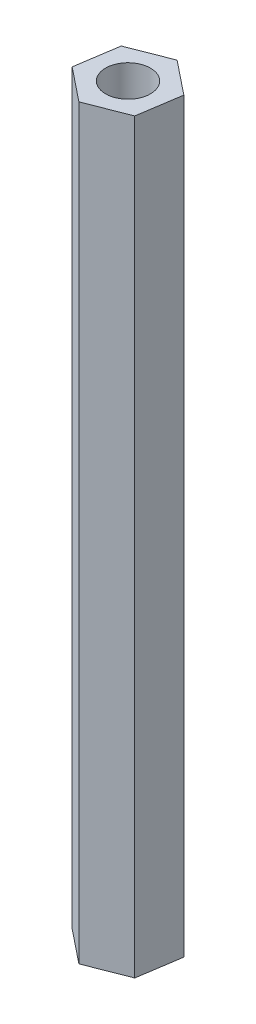
ISO-10303-21;
HEADER;
FILE_DESCRIPTION(('STEP AP214'),'2;1');
FILE_NAME('part.step','',(''),(''),'','','');
FILE_SCHEMA(('AUTOMOTIVE_DESIGN { 1 0 10303 214 1 1 1 1 }'));
ENDSEC;
DATA;
#1=APPLICATION_CONTEXT('core data for automotive mechanical design processes');
#2=APPLICATION_PROTOCOL_DEFINITION('international standard','automotive_design',2000,#1);
#3=PRODUCT_CONTEXT('',#1,'mechanical');
#4=PRODUCT('Part','Part','',(#3));
#5=PRODUCT_RELATED_PRODUCT_CATEGORY('part','',(#4));
#6=PRODUCT_DEFINITION_FORMATION('','',#4);
#7=PRODUCT_DEFINITION_CONTEXT('part definition',#1,'design');
#8=PRODUCT_DEFINITION('design','',#6,#7);
#9=PRODUCT_DEFINITION_SHAPE('','',#8);
#10=(LENGTH_UNIT() NAMED_UNIT(*) SI_UNIT(.MILLI.,.METRE.));
#11=(NAMED_UNIT(*) PLANE_ANGLE_UNIT() SI_UNIT($,.RADIAN.));
#12=(NAMED_UNIT(*) SI_UNIT($,.STERADIAN.) SOLID_ANGLE_UNIT());
#13=UNCERTAINTY_MEASURE_WITH_UNIT(LENGTH_MEASURE(1.E-05),#10,'distance_accuracy_value','');
#14=(GEOMETRIC_REPRESENTATION_CONTEXT(3) GLOBAL_UNCERTAINTY_ASSIGNED_CONTEXT((#13)) GLOBAL_UNIT_ASSIGNED_CONTEXT((#10,
#11,#12)) REPRESENTATION_CONTEXT('',''));
#15=CARTESIAN_POINT('',(0.,0.,0.));
#16=DIRECTION('',(0.,0.,1.));
#17=DIRECTION('',(1.,0.,0.));
#18=AXIS2_PLACEMENT_3D('',#15,#16,#17);
#19=CARTESIAN_POINT('',(0.,50.,0.));
#20=DIRECTION('',(0.,1.,0.));
#21=DIRECTION('',(0.,0.,1.));
#22=AXIS2_PLACEMENT_3D('',#19,#20,#21);
#23=PLANE('',#22);
#24=DIRECTION('',(0.931436185521971,0.,-0.36390470222337));
#25=VECTOR('',#24,1.);
#26=CARTESIAN_POINT('',(-0.434650575551744,50.,2.85384165827501));
#27=LINE('',#26,#25);
#28=CARTESIAN_POINT('',(-0.434650575551744,50.,2.85384165827501));
#29=VERTEX_POINT('',#28);
#30=CARTESIAN_POINT('',(2.2541740866686,50.,1.80333926933485));
#31=VERTEX_POINT('',#30);
#32=EDGE_CURVE('E139',#29,#31,#27,.T.);
#33=ORIENTED_EDGE('',*,*,#32,.T.);
#34=DIRECTION('',(0.150567376078936,0.,-0.988599749777788));
#35=VECTOR('',#34,1.);
#36=CARTESIAN_POINT('',(2.2541740866686,50.,1.80333926933485));
#37=LINE('',#36,#35);
#38=CARTESIAN_POINT('',(2.68882466222034,50.,-1.05050238894017));
#39=VERTEX_POINT('',#38);
#40=EDGE_CURVE('E97',#31,#39,#37,.T.);
#41=ORIENTED_EDGE('',*,*,#40,.T.);
#42=DIRECTION('',(-0.780868809443035,0.,-0.624695047554418));
#43=VECTOR('',#42,1.);
#44=CARTESIAN_POINT('',(2.68882466222034,50.,-1.05050238894017));
#45=LINE('',#44,#43);
#46=CARTESIAN_POINT('',(0.434650575551747,50.,-2.85384165827501));
#47=VERTEX_POINT('',#46);
#48=EDGE_CURVE('E110',#39,#47,#45,.T.);
#49=ORIENTED_EDGE('',*,*,#48,.T.);
#50=DIRECTION('',(-0.931436185521971,0.,0.36390470222337));
#51=VECTOR('',#50,1.);
#52=CARTESIAN_POINT('',(0.434650575551747,50.,-2.85384165827501));
#53=LINE('',#52,#51);
#54=CARTESIAN_POINT('',(-2.2541740866686,50.,-1.80333926933485));
#55=VERTEX_POINT('',#54);
#56=EDGE_CURVE('E104',#47,#55,#53,.T.);
#57=ORIENTED_EDGE('',*,*,#56,.T.);
#58=DIRECTION('',(-0.150567376078936,0.,0.988599749777788));
#59=VECTOR('',#58,1.);
#60=CARTESIAN_POINT('',(-2.2541740866686,50.,-1.80333926933485));
#61=LINE('',#60,#59);
#62=CARTESIAN_POINT('',(-2.68882466222034,50.,1.05050238894017));
#63=VERTEX_POINT('',#62);
#64=EDGE_CURVE('E108',#55,#63,#61,.T.);
#65=ORIENTED_EDGE('',*,*,#64,.T.);
#66=DIRECTION('',(0.780868809443036,0.,0.624695047554418));
#67=VECTOR('',#66,1.);
#68=CARTESIAN_POINT('',(-2.68882466222034,50.,1.05050238894017));
#69=LINE('',#68,#67);
#70=EDGE_CURVE('E60',#63,#29,#69,.T.);
#71=ORIENTED_EDGE('',*,*,#70,.T.);
#72=EDGE_LOOP('',(#33,#41,#49,#57,#65,#71));
#73=FACE_BOUND('',#72,.T.);
#74=CARTESIAN_POINT('',(0.,50.,0.));
#75=DIRECTION('',(0.,1.,0.));
#76=DIRECTION('',(0.,0.,1.));
#77=AXIS2_PLACEMENT_3D('',#74,#75,#76);
#78=CIRCLE('',#77,1.5);
#79=CARTESIAN_POINT('',(0.,50.,1.5));
#80=VERTEX_POINT('',#79);
#81=EDGE_CURVE('E132',#80,#80,#78,.T.);
#82=ORIENTED_EDGE('',*,*,#81,.F.);
#83=EDGE_LOOP('',(#82));
#84=FACE_BOUND('',#83,.T.);
#85=ADVANCED_FACE('F43',(#73,#84),#23,.T.);
#86=CARTESIAN_POINT('',(0.,0.,0.));
#87=DIRECTION('',(0.,1.,0.));
#88=DIRECTION('',(0.,0.,1.));
#89=AXIS2_PLACEMENT_3D('',#86,#87,#88);
#90=PLANE('',#89);
#91=DIRECTION('',(0.931436185521971,0.,-0.36390470222337));
#92=VECTOR('',#91,1.);
#93=CARTESIAN_POINT('',(-0.434650575551744,0.,2.85384165827501));
#94=LINE('',#93,#92);
#95=CARTESIAN_POINT('',(-0.434650575551744,0.,2.85384165827501));
#96=VERTEX_POINT('',#95);
#97=CARTESIAN_POINT('',(2.2541740866686,0.,1.80333926933485));
#98=VERTEX_POINT('',#97);
#99=EDGE_CURVE('E128',#96,#98,#94,.T.);
#100=ORIENTED_EDGE('',*,*,#99,.F.);
#101=DIRECTION('',(0.780868809443036,0.,0.624695047554418));
#102=VECTOR('',#101,1.);
#103=CARTESIAN_POINT('',(-2.68882466222034,0.,1.05050238894017));
#104=LINE('',#103,#102);
#105=CARTESIAN_POINT('',(-2.68882466222034,0.,1.05050238894017));
#106=VERTEX_POINT('',#105);
#107=EDGE_CURVE('E89',#106,#96,#104,.T.);
#108=ORIENTED_EDGE('',*,*,#107,.F.);
#109=DIRECTION('',(-0.150567376078936,0.,0.988599749777788));
#110=VECTOR('',#109,1.);
#111=CARTESIAN_POINT('',(-2.2541740866686,0.,-1.80333926933485));
#112=LINE('',#111,#110);
#113=CARTESIAN_POINT('',(-2.2541740866686,0.,-1.80333926933485));
#114=VERTEX_POINT('',#113);
#115=EDGE_CURVE('E83',#114,#106,#112,.T.);
#116=ORIENTED_EDGE('',*,*,#115,.F.);
#117=DIRECTION('',(-0.931436185521971,0.,0.36390470222337));
#118=VECTOR('',#117,1.);
#119=CARTESIAN_POINT('',(0.434650575551747,0.,-2.85384165827501));
#120=LINE('',#119,#118);
#121=CARTESIAN_POINT('',(0.434650575551747,0.,-2.85384165827501));
#122=VERTEX_POINT('',#121);
#123=EDGE_CURVE('E118',#122,#114,#120,.T.);
#124=ORIENTED_EDGE('',*,*,#123,.F.);
#125=DIRECTION('',(-0.780868809443035,0.,-0.624695047554418));
#126=VECTOR('',#125,1.);
#127=CARTESIAN_POINT('',(2.68882466222034,0.,-1.05050238894017));
#128=LINE('',#127,#126);
#129=CARTESIAN_POINT('',(2.68882466222034,0.,-1.05050238894017));
#130=VERTEX_POINT('',#129);
#131=EDGE_CURVE('E134',#130,#122,#128,.T.);
#132=ORIENTED_EDGE('',*,*,#131,.F.);
#133=DIRECTION('',(0.150567376078936,0.,-0.988599749777788));
#134=VECTOR('',#133,1.);
#135=CARTESIAN_POINT('',(2.2541740866686,0.,1.80333926933485));
#136=LINE('',#135,#134);
#137=EDGE_CURVE('E131',#98,#130,#136,.T.);
#138=ORIENTED_EDGE('',*,*,#137,.F.);
#139=EDGE_LOOP('',(#100,#108,#116,#124,#132,#138));
#140=FACE_BOUND('',#139,.T.);
#141=CARTESIAN_POINT('',(0.,0.,0.));
#142=DIRECTION('',(0.,1.,0.));
#143=DIRECTION('',(0.,0.,1.));
#144=AXIS2_PLACEMENT_3D('',#141,#142,#143);
#145=CIRCLE('',#144,1.5);
#146=CARTESIAN_POINT('',(0.,0.,1.5));
#147=VERTEX_POINT('',#146);
#148=EDGE_CURVE('E250',#147,#147,#145,.T.);
#149=ORIENTED_EDGE('',*,*,#148,.T.);
#150=EDGE_LOOP('',(#149));
#151=FACE_BOUND('',#150,.T.);
#152=ADVANCED_FACE('F148',(#140,#151),#90,.F.);
#153=CARTESIAN_POINT('',(-0.434650575551744,50.,2.85384165827501));
#154=DIRECTION('',(-0.36390470222337,0.,-0.931436185521972));
#155=DIRECTION('',(-0.931436185521972,0.,0.36390470222337));
#156=AXIS2_PLACEMENT_3D('',#153,#154,#155);
#157=PLANE('',#156);
#158=ORIENTED_EDGE('',*,*,#99,.T.);
#159=DIRECTION('',(0.,-1.,0.));
#160=VECTOR('',#159,1.);
#161=CARTESIAN_POINT('',(2.2541740866686,50.,1.80333926933485));
#162=LINE('',#161,#160);
#163=EDGE_CURVE('E11',#31,#98,#162,.T.);
#164=ORIENTED_EDGE('',*,*,#163,.F.);
#165=ORIENTED_EDGE('',*,*,#32,.F.);
#166=DIRECTION('',(0.,-1.,0.));
#167=VECTOR('',#166,1.);
#168=CARTESIAN_POINT('',(-0.434650575551744,50.,2.85384165827501));
#169=LINE('',#168,#167);
#170=EDGE_CURVE('E124',#29,#96,#169,.T.);
#171=ORIENTED_EDGE('',*,*,#170,.T.);
#172=EDGE_LOOP('',(#158,#164,#165,#171));
#173=FACE_BOUND('',#172,.T.);
#174=ADVANCED_FACE('F45',(#173),#157,.F.);
#175=CARTESIAN_POINT('',(2.2541740866686,50.,1.80333926933485));
#176=DIRECTION('',(-0.988599749777788,0.,-0.150567376078936));
#177=DIRECTION('',(-0.150567376078936,0.,0.988599749777788));
#178=AXIS2_PLACEMENT_3D('',#175,#176,#177);
#179=PLANE('',#178);
#180=ORIENTED_EDGE('',*,*,#137,.T.);
#181=DIRECTION('',(0.,-1.,0.));
#182=VECTOR('',#181,1.);
#183=CARTESIAN_POINT('',(2.68882466222034,50.,-1.05050238894017));
#184=LINE('',#183,#182);
#185=EDGE_CURVE('E52',#39,#130,#184,.T.);
#186=ORIENTED_EDGE('',*,*,#185,.F.);
#187=ORIENTED_EDGE('',*,*,#40,.F.);
#188=ORIENTED_EDGE('',*,*,#163,.T.);
#189=EDGE_LOOP('',(#180,#186,#187,#188));
#190=FACE_BOUND('',#189,.T.);
#191=ADVANCED_FACE('F173',(#190),#179,.F.);
#192=CARTESIAN_POINT('',(2.68882466222034,50.,-1.05050238894017));
#193=DIRECTION('',(-0.624695047554418,0.,0.780868809443035));
#194=DIRECTION('',(0.780868809443035,0.,0.624695047554418));
#195=AXIS2_PLACEMENT_3D('',#192,#193,#194);
#196=PLANE('',#195);
#197=ORIENTED_EDGE('',*,*,#131,.T.);
#198=DIRECTION('',(0.,-1.,0.));
#199=VECTOR('',#198,1.);
#200=CARTESIAN_POINT('',(0.434650575551747,50.,-2.85384165827501));
#201=LINE('',#200,#199);
#202=EDGE_CURVE('E119',#47,#122,#201,.T.);
#203=ORIENTED_EDGE('',*,*,#202,.F.);
#204=ORIENTED_EDGE('',*,*,#48,.F.);
#205=ORIENTED_EDGE('',*,*,#185,.T.);
#206=EDGE_LOOP('',(#197,#203,#204,#205));
#207=FACE_BOUND('',#206,.T.);
#208=ADVANCED_FACE('F145',(#207),#196,.F.);
#209=CARTESIAN_POINT('',(0.434650575551747,50.,-2.85384165827501));
#210=DIRECTION('',(0.36390470222337,0.,0.931436185521972));
#211=DIRECTION('',(0.931436185521972,0.,-0.36390470222337));
#212=AXIS2_PLACEMENT_3D('',#209,#210,#211);
#213=PLANE('',#212);
#214=ORIENTED_EDGE('',*,*,#123,.T.);
#215=DIRECTION('',(0.,-1.,0.));
#216=VECTOR('',#215,1.);
#217=CARTESIAN_POINT('',(-2.2541740866686,50.,-1.80333926933485));
#218=LINE('',#217,#216);
#219=EDGE_CURVE('E115',#55,#114,#218,.T.);
#220=ORIENTED_EDGE('',*,*,#219,.F.);
#221=ORIENTED_EDGE('',*,*,#56,.F.);
#222=ORIENTED_EDGE('',*,*,#202,.T.);
#223=EDGE_LOOP('',(#214,#220,#221,#222));
#224=FACE_BOUND('',#223,.T.);
#225=ADVANCED_FACE('F116',(#224),#213,.F.);
#226=CARTESIAN_POINT('',(-2.2541740866686,50.,-1.80333926933485));
#227=DIRECTION('',(0.988599749777788,0.,0.150567376078936));
#228=DIRECTION('',(0.150567376078936,0.,-0.988599749777788));
#229=AXIS2_PLACEMENT_3D('',#226,#227,#228);
#230=PLANE('',#229);
#231=ORIENTED_EDGE('',*,*,#115,.T.);
#232=DIRECTION('',(0.,-1.,0.));
#233=VECTOR('',#232,1.);
#234=CARTESIAN_POINT('',(-2.68882466222034,50.,1.05050238894017));
#235=LINE('',#234,#233);
#236=EDGE_CURVE('E120',#63,#106,#235,.T.);
#237=ORIENTED_EDGE('',*,*,#236,.F.);
#238=ORIENTED_EDGE('',*,*,#64,.F.);
#239=ORIENTED_EDGE('',*,*,#219,.T.);
#240=EDGE_LOOP('',(#231,#237,#238,#239));
#241=FACE_BOUND('',#240,.T.);
#242=ADVANCED_FACE('F122',(#241),#230,.F.);
#243=CARTESIAN_POINT('',(-2.68882466222034,50.,1.05050238894017));
#244=DIRECTION('',(0.624695047554418,0.,-0.780868809443036));
#245=DIRECTION('',(-0.780868809443036,0.,-0.624695047554418));
#246=AXIS2_PLACEMENT_3D('',#243,#244,#245);
#247=PLANE('',#246);
#248=ORIENTED_EDGE('',*,*,#107,.T.);
#249=ORIENTED_EDGE('',*,*,#170,.F.);
#250=ORIENTED_EDGE('',*,*,#70,.F.);
#251=ORIENTED_EDGE('',*,*,#236,.T.);
#252=EDGE_LOOP('',(#248,#249,#250,#251));
#253=FACE_BOUND('',#252,.T.);
#254=ADVANCED_FACE('F153',(#253),#247,.F.);
#255=CARTESIAN_POINT('',(0.,50.,0.));
#256=DIRECTION('',(0.,-1.,0.));
#257=DIRECTION('',(0.,0.,-1.));
#258=AXIS2_PLACEMENT_3D('',#255,#256,#257);
#259=CYLINDRICAL_SURFACE('',#258,1.5);
#260=ORIENTED_EDGE('',*,*,#81,.T.);
#261=EDGE_LOOP('',(#260));
#262=FACE_BOUND('',#261,.T.);
#263=ORIENTED_EDGE('',*,*,#148,.F.);
#264=EDGE_LOOP('',(#263));
#265=FACE_BOUND('',#264,.T.);
#266=ADVANCED_FACE('F155',(#262,#265),#259,.F.);
#267=CLOSED_SHELL('',(#85,#152,#174,#191,#208,#225,#242,#254,#266));
#268=MANIFOLD_SOLID_BREP('B2',#267);
#269=ADVANCED_BREP_SHAPE_REPRESENTATION('',(#18,#268),#14);
#270=SHAPE_DEFINITION_REPRESENTATION(#9,#269);
ENDSEC;
END-ISO-10303-21;
